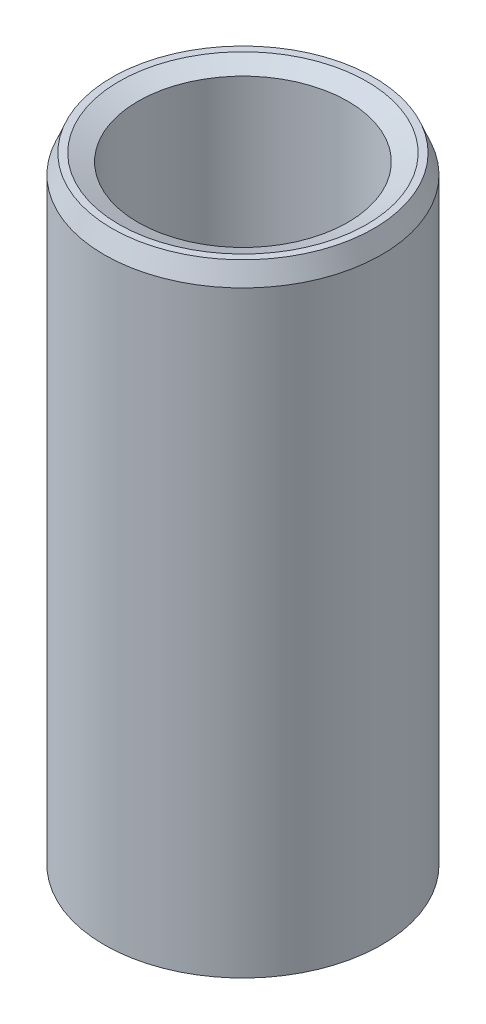
ISO-10303-21;
HEADER;
FILE_DESCRIPTION(('STEP AP214'),'2;1');
FILE_NAME('part.step','',(''),(''),'','','');
FILE_SCHEMA(('AUTOMOTIVE_DESIGN { 1 0 10303 214 1 1 1 1 }'));
ENDSEC;
DATA;
#1=APPLICATION_CONTEXT('core data for automotive mechanical design processes');
#2=APPLICATION_PROTOCOL_DEFINITION('international standard','automotive_design',2000,#1);
#3=PRODUCT_CONTEXT('',#1,'mechanical');
#4=PRODUCT('Part','Part','',(#3));
#5=PRODUCT_RELATED_PRODUCT_CATEGORY('part','',(#4));
#6=PRODUCT_DEFINITION_FORMATION('','',#4);
#7=PRODUCT_DEFINITION_CONTEXT('part definition',#1,'design');
#8=PRODUCT_DEFINITION('design','',#6,#7);
#9=PRODUCT_DEFINITION_SHAPE('','',#8);
#10=(LENGTH_UNIT() NAMED_UNIT(*) SI_UNIT(.MILLI.,.METRE.));
#11=(NAMED_UNIT(*) PLANE_ANGLE_UNIT() SI_UNIT($,.RADIAN.));
#12=(NAMED_UNIT(*) SI_UNIT($,.STERADIAN.) SOLID_ANGLE_UNIT());
#13=UNCERTAINTY_MEASURE_WITH_UNIT(LENGTH_MEASURE(1.E-05),#10,'distance_accuracy_value','');
#14=(GEOMETRIC_REPRESENTATION_CONTEXT(3) GLOBAL_UNCERTAINTY_ASSIGNED_CONTEXT((#13)) GLOBAL_UNIT_ASSIGNED_CONTEXT((#10,
#11,#12)) REPRESENTATION_CONTEXT('',''));
#15=CARTESIAN_POINT('',(0.,0.,0.));
#16=DIRECTION('',(0.,0.,1.));
#17=DIRECTION('',(1.,0.,0.));
#18=AXIS2_PLACEMENT_3D('',#15,#16,#17);
#19=CARTESIAN_POINT('',(0.,78.797027267771,0.));
#20=DIRECTION('',(0.,-1.,0.));
#21=DIRECTION('',(0.,0.,-1.));
#22=AXIS2_PLACEMENT_3D('',#19,#20,#21);
#23=CYLINDRICAL_SURFACE('',#22,17.5);
#24=CARTESIAN_POINT('',(0.,0.972885822807718,0.));
#25=DIRECTION('',(0.,1.,0.));
#26=DIRECTION('',(0.,0.,1.));
#27=AXIS2_PLACEMENT_3D('',#24,#25,#26);
#28=CIRCLE('',#27,17.5);
#29=CARTESIAN_POINT('',(0.,0.972885822807718,17.5));
#30=VERTEX_POINT('',#29);
#31=EDGE_CURVE('E10',#30,#30,#28,.T.);
#32=ORIENTED_EDGE('',*,*,#31,.T.);
#33=EDGE_LOOP('',(#32));
#34=FACE_BOUND('',#33,.T.);
#35=CARTESIAN_POINT('',(0.,76.4055622608457,0.));
#36=DIRECTION('',(0.,1.,0.));
#37=DIRECTION('',(0.,0.,1.));
#38=AXIS2_PLACEMENT_3D('',#35,#36,#37);
#39=CIRCLE('',#38,17.5);
#40=CARTESIAN_POINT('',(0.,76.4055622608457,17.5));
#41=VERTEX_POINT('',#40);
#42=EDGE_CURVE('E50',#41,#41,#39,.F.);
#43=ORIENTED_EDGE('',*,*,#42,.T.);
#44=EDGE_LOOP('',(#43));
#45=FACE_BOUND('',#44,.T.);
#46=ADVANCED_FACE('F39',(#34,#45),#23,.T.);
#47=CARTESIAN_POINT('',(0.,78.797027267771,0.));
#48=DIRECTION('',(0.,1.,0.));
#49=DIRECTION('',(0.,0.,1.));
#50=AXIS2_PLACEMENT_3D('',#47,#48,#49);
#51=PLANE('',#50);
#52=CARTESIAN_POINT('',(0.,78.797027267771,0.));
#53=DIRECTION('',(0.,1.,0.));
#54=DIRECTION('',(0.,0.,1.));
#55=AXIS2_PLACEMENT_3D('',#52,#53,#54);
#56=CIRCLE('',#55,15.6388109043403);
#57=CARTESIAN_POINT('',(0.,78.797027267771,15.6388109043403));
#58=VERTEX_POINT('',#57);
#59=EDGE_CURVE('E58',#58,#58,#56,.F.);
#60=ORIENTED_EDGE('',*,*,#59,.T.);
#61=EDGE_LOOP('',(#60));
#62=FACE_BOUND('',#61,.T.);
#63=CARTESIAN_POINT('',(0.,78.797027267771,0.));
#64=DIRECTION('',(0.,1.,0.));
#65=DIRECTION('',(0.,0.,1.));
#66=AXIS2_PLACEMENT_3D('',#63,#64,#65);
#67=CIRCLE('',#66,16.5271141771923);
#68=CARTESIAN_POINT('',(0.,78.797027267771,16.5271141771923));
#69=VERTEX_POINT('',#68);
#70=EDGE_CURVE('E61',#69,#69,#67,.T.);
#71=ORIENTED_EDGE('',*,*,#70,.T.);
#72=EDGE_LOOP('',(#71));
#73=FACE_BOUND('',#72,.T.);
#74=ADVANCED_FACE('F88',(#62,#73),#51,.T.);
#75=CARTESIAN_POINT('',(0.,0.,0.));
#76=DIRECTION('',(0.,1.,0.));
#77=DIRECTION('',(0.,0.,1.));
#78=AXIS2_PLACEMENT_3D('',#75,#76,#77);
#79=PLANE('',#78);
#80=CARTESIAN_POINT('',(0.,0.,0.));
#81=DIRECTION('',(0.,1.,0.));
#82=DIRECTION('',(0.,0.,1.));
#83=AXIS2_PLACEMENT_3D('',#80,#81,#82);
#84=CIRCLE('',#83,14.2202317202227);
#85=CARTESIAN_POINT('',(0.,0.,14.2202317202227));
#86=VERTEX_POINT('',#85);
#87=EDGE_CURVE('E51',#86,#86,#84,.T.);
#88=ORIENTED_EDGE('',*,*,#87,.T.);
#89=EDGE_LOOP('',(#88));
#90=FACE_BOUND('',#89,.T.);
#91=CARTESIAN_POINT('',(0.,0.,0.));
#92=DIRECTION('',(0.,1.,0.));
#93=DIRECTION('',(0.,0.,1.));
#94=AXIS2_PLACEMENT_3D('',#91,#92,#93);
#95=CIRCLE('',#94,15.1085349930747);
#96=CARTESIAN_POINT('',(0.,0.,15.1085349930747));
#97=VERTEX_POINT('',#96);
#98=EDGE_CURVE('E54',#97,#97,#95,.F.);
#99=ORIENTED_EDGE('',*,*,#98,.T.);
#100=EDGE_LOOP('',(#99));
#101=FACE_BOUND('',#100,.T.);
#102=ADVANCED_FACE('F83',(#90,#101),#79,.F.);
#103=CARTESIAN_POINT('',(0.,78.797027267771,0.));
#104=DIRECTION('',(0.,-1.,0.));
#105=DIRECTION('',(0.,0.,-1.));
#106=AXIS2_PLACEMENT_3D('',#103,#104,#105);
#107=CYLINDRICAL_SURFACE('',#106,13.247345897415);
#108=CARTESIAN_POINT('',(0.,77.8241414449633,0.));
#109=DIRECTION('',(0.,1.,0.));
#110=DIRECTION('',(0.,0.,1.));
#111=AXIS2_PLACEMENT_3D('',#108,#109,#110);
#112=CIRCLE('',#111,13.247345897415);
#113=CARTESIAN_POINT('',(0.,77.8241414449633,13.247345897415));
#114=VERTEX_POINT('',#113);
#115=EDGE_CURVE('E67',#114,#114,#112,.T.);
#116=ORIENTED_EDGE('',*,*,#115,.T.);
#117=EDGE_LOOP('',(#116));
#118=FACE_BOUND('',#117,.T.);
#119=CARTESIAN_POINT('',(0.,2.39146500692532,0.));
#120=DIRECTION('',(0.,1.,0.));
#121=DIRECTION('',(0.,0.,1.));
#122=AXIS2_PLACEMENT_3D('',#119,#120,#121);
#123=CIRCLE('',#122,13.247345897415);
#124=CARTESIAN_POINT('',(0.,2.39146500692532,13.247345897415));
#125=VERTEX_POINT('',#124);
#126=EDGE_CURVE('E69',#125,#125,#123,.F.);
#127=ORIENTED_EDGE('',*,*,#126,.T.);
#128=EDGE_LOOP('',(#127));
#129=FACE_BOUND('',#128,.T.);
#130=ADVANCED_FACE('F71',(#118,#129),#107,.F.);
#131=CARTESIAN_POINT('',(0.,77.8241414449633,0.));
#132=DIRECTION('',(0.,1.,0.));
#133=DIRECTION('',(0.,0.,1.));
#134=AXIS2_PLACEMENT_3D('',#131,#132,#133);
#135=CONICAL_SURFACE('',#134,13.247345897415,1.18442807814543);
#136=ORIENTED_EDGE('',*,*,#59,.F.);
#137=EDGE_LOOP('',(#136));
#138=FACE_BOUND('',#137,.T.);
#139=ORIENTED_EDGE('',*,*,#115,.F.);
#140=EDGE_LOOP('',(#139));
#141=FACE_BOUND('',#140,.T.);
#142=ADVANCED_FACE('F77',(#138,#141),#135,.F.);
#143=CARTESIAN_POINT('',(0.,0.,0.));
#144=DIRECTION('',(0.,-1.,0.));
#145=DIRECTION('',(0.,0.,-1.));
#146=AXIS2_PLACEMENT_3D('',#143,#144,#145);
#147=CONICAL_SURFACE('',#146,14.2202317202227,0.386368248649474);
#148=ORIENTED_EDGE('',*,*,#126,.F.);
#149=EDGE_LOOP('',(#148));
#150=FACE_BOUND('',#149,.T.);
#151=ORIENTED_EDGE('',*,*,#87,.F.);
#152=EDGE_LOOP('',(#151));
#153=FACE_BOUND('',#152,.T.);
#154=ADVANCED_FACE('F73',(#150,#153),#147,.F.);
#155=CARTESIAN_POINT('',(0.,0.972885822807718,0.));
#156=DIRECTION('',(0.,1.,0.));
#157=DIRECTION('',(0.,0.,1.));
#158=AXIS2_PLACEMENT_3D('',#155,#156,#157);
#159=CONICAL_SURFACE('',#158,17.5,1.18442807814542);
#160=CARTESIAN_POINT('',(0.,0.,15.1085349930747));
#161=CARTESIAN_POINT('',(0.,0.0101342273209137,15.1334460868968));
#162=CARTESIAN_POINT('',(0.,0.0202684546418274,15.1583571807189));
#163=CARTESIAN_POINT('',(0.,0.0405369092836548,15.2081793683632));
#164=CARTESIAN_POINT('',(0.,0.0506711366045685,15.2330904621854));
#165=CARTESIAN_POINT('',(0.,0.070939591246396,15.2829126498296));
#166=CARTESIAN_POINT('',(0.,0.0810738185673098,15.3078237436518));
#167=CARTESIAN_POINT('',(0.,0.101342273209137,15.357645931296));
#168=CARTESIAN_POINT('',(0.,0.111476500530051,15.3825570251182));
#169=CARTESIAN_POINT('',(0.,0.131744955171878,15.4323792127625));
#170=CARTESIAN_POINT('',(0.,0.141879182492792,15.4572903065846));
#171=CARTESIAN_POINT('',(0.,0.16214763713462,15.5071124942289));
#172=CARTESIAN_POINT('',(0.,0.172281864455533,15.532023588051));
#173=CARTESIAN_POINT('',(0.,0.192550319097361,15.5818457756953));
#174=CARTESIAN_POINT('',(0.,0.202684546418274,15.6067568695174));
#175=CARTESIAN_POINT('',(0.,0.222953001060102,15.6565790571617));
#176=CARTESIAN_POINT('',(0.,0.233087228381016,15.6814901509839));
#177=CARTESIAN_POINT('',(0.,0.253355683022843,15.7313123386281));
#178=CARTESIAN_POINT('',(0.,0.263489910343757,15.7562234324503));
#179=CARTESIAN_POINT('',(0.,0.283758364985584,15.8060456200945));
#180=CARTESIAN_POINT('',(0.,0.293892592306498,15.8309567139167));
#181=CARTESIAN_POINT('',(0.,0.314161046948325,15.880778901561));
#182=CARTESIAN_POINT('',(0.,0.324295274269239,15.9056899953831));
#183=CARTESIAN_POINT('',(0.,0.344563728911067,15.9555121830274));
#184=CARTESIAN_POINT('',(0.,0.35469795623198,15.9804232768495));
#185=CARTESIAN_POINT('',(0.,0.374966410873808,16.0302454644938));
#186=CARTESIAN_POINT('',(0.,0.385100638194721,16.0551565583159));
#187=CARTESIAN_POINT('',(0.,0.405369092836549,16.1049787459602));
#188=CARTESIAN_POINT('',(0.,0.415503320157463,16.1298898397824));
#189=CARTESIAN_POINT('',(0.,0.43577177479929,16.1797120274266));
#190=CARTESIAN_POINT('',(0.,0.445906002120204,16.2046231212488));
#191=CARTESIAN_POINT('',(0.,0.466174456762031,16.2544453088931));
#192=CARTESIAN_POINT('',(0.,0.476308684082945,16.2793564027152));
#193=CARTESIAN_POINT('',(0.,0.496577138724773,16.3291785903595));
#194=CARTESIAN_POINT('',(0.,0.506711366045686,16.3540896841816));
#195=CARTESIAN_POINT('',(0.,0.526979820687513,16.4039118718259));
#196=CARTESIAN_POINT('',(0.,0.537114048008427,16.428822965648));
#197=CARTESIAN_POINT('',(0.,0.557382502650255,16.4786451532923));
#198=CARTESIAN_POINT('',(0.,0.567516729971169,16.5035562471144));
#199=CARTESIAN_POINT('',(0.,0.587785184612996,16.5533784347587));
#200=CARTESIAN_POINT('',(0.,0.59791941193391,16.5782895285809));
#201=CARTESIAN_POINT('',(0.,0.618187866575737,16.6281117162251));
#202=CARTESIAN_POINT('',(0.,0.628322093896651,16.6530228100473));
#203=CARTESIAN_POINT('',(0.,0.648590548538478,16.7028449976916));
#204=CARTESIAN_POINT('',(0.,0.658724775859392,16.7277560915137));
#205=CARTESIAN_POINT('',(0.,0.67899323050122,16.777578279158));
#206=CARTESIAN_POINT('',(0.,0.689127457822133,16.8024893729801));
#207=CARTESIAN_POINT('',(0.,0.709395912463961,16.8523115606244));
#208=CARTESIAN_POINT('',(0.,0.719530139784874,16.8772226544465));
#209=CARTESIAN_POINT('',(0.,0.739798594426702,16.9270448420908));
#210=CARTESIAN_POINT('',(0.,0.749932821747616,16.9519559359129));
#211=CARTESIAN_POINT('',(0.,0.770201276389443,17.0017781235572));
#212=CARTESIAN_POINT('',(0.,0.780335503710357,17.0266892173794));
#213=CARTESIAN_POINT('',(0.,0.800603958352184,17.0765114050236));
#214=CARTESIAN_POINT('',(0.,0.810738185673098,17.1014224988458));
#215=CARTESIAN_POINT('',(0.,0.831006640314925,17.1512446864901));
#216=CARTESIAN_POINT('',(0.,0.841140867635839,17.1761557803122));
#217=CARTESIAN_POINT('',(0.,0.861409322277667,17.2259779679565));
#218=CARTESIAN_POINT('',(0.,0.87154354959858,17.2508890617786));
#219=CARTESIAN_POINT('',(0.,0.891812004240408,17.3007112494229));
#220=CARTESIAN_POINT('',(0.,0.901946231561321,17.325622343245));
#221=CARTESIAN_POINT('',(0.,0.922214686203149,17.3754445308893));
#222=CARTESIAN_POINT('',(0.,0.932348913524063,17.4003556247114));
#223=CARTESIAN_POINT('',(0.,0.95261736816589,17.4501778123557));
#224=CARTESIAN_POINT('',(0.,0.962751595486804,17.4750889061779));
#225=CARTESIAN_POINT('',(0.,0.972885822807718,17.5));
#226=B_SPLINE_CURVE_WITH_KNOTS('',3,(#160,#161,#162,#163,#164,#165,#166,#167,#168,#169,#170,
#171,#172,#173,#174,#175,#176,#177,#178,#179,#180,#181,#182,#183,#184,#185,#186,#187,#188,#189,
#190,#191,#192,#193,#194,#195,#196,#197,#198,#199,#200,#201,#202,#203,#204,#205,#206,#207,#208,
#209,#210,#211,#212,#213,#214,#215,#216,#217,#218,#219,#220,#221,#222,#223,#224,#225),
.UNSPECIFIED.,.F.,.F.,(4,2,2,2,2,2,2,2,2,2,2,2,2,2,2,2,2,2,2,2,2,2,2,2,2,2,2,2,2,2,2,2,4),(0.,
0.0806807686457326,0.161361537291465,0.242042305937198,0.322723074582932,0.403403843228665,
0.484084611874399,0.564765380520131,0.645446149165864,0.726126917811597,0.806807686457329,
0.887488455103062,0.968169223748798,1.04884999239453,1.12953076104026,1.210211529686,
1.29089229833173,1.37157306697746,1.4522538356232,1.53293460426893,1.61361537291466,
1.69429614156039,1.77497691020613,1.85565767885186,1.9363384474976,2.01701921614333,
2.09769998478906,2.17838075343479,2.25906152208053,2.33974229072626,2.42042305937199,
2.50110382801773,2.58178459666346),.UNSPECIFIED.);
#227=EDGE_CURVE('BSEAM76',#97,#30,#226,.T.);
#228=ORIENTED_EDGE('',*,*,#98,.F.);
#229=ORIENTED_EDGE('',*,*,#31,.F.);
#230=ORIENTED_EDGE('',*,*,#227,.T.);
#231=ORIENTED_EDGE('',*,*,#227,.F.);
#232=EDGE_LOOP('',(#228,#230,#229,#231));
#233=FACE_BOUND('',#232,.T.);
#234=ADVANCED_FACE('F76',(#233),#159,.T.);
#235=CARTESIAN_POINT('',(0.,78.797027267771,0.));
#236=DIRECTION('',(0.,-1.,0.));
#237=DIRECTION('',(0.,0.,-1.));
#238=AXIS2_PLACEMENT_3D('',#235,#236,#237);
#239=CONICAL_SURFACE('',#238,16.5271141771923,0.386368248649477);
#240=ORIENTED_EDGE('',*,*,#42,.F.);
#241=EDGE_LOOP('',(#240));
#242=FACE_BOUND('',#241,.T.);
#243=ORIENTED_EDGE('',*,*,#70,.F.);
#244=EDGE_LOOP('',(#243));
#245=FACE_BOUND('',#244,.T.);
#246=ADVANCED_FACE('F45',(#242,#245),#239,.T.);
#247=CLOSED_SHELL('',(#46,#74,#102,#130,#142,#154,#234,#246));
#248=MANIFOLD_SOLID_BREP('B2',#247);
#249=ADVANCED_BREP_SHAPE_REPRESENTATION('',(#18,#248),#14);
#250=SHAPE_DEFINITION_REPRESENTATION(#9,#249);
ENDSEC;
END-ISO-10303-21;
